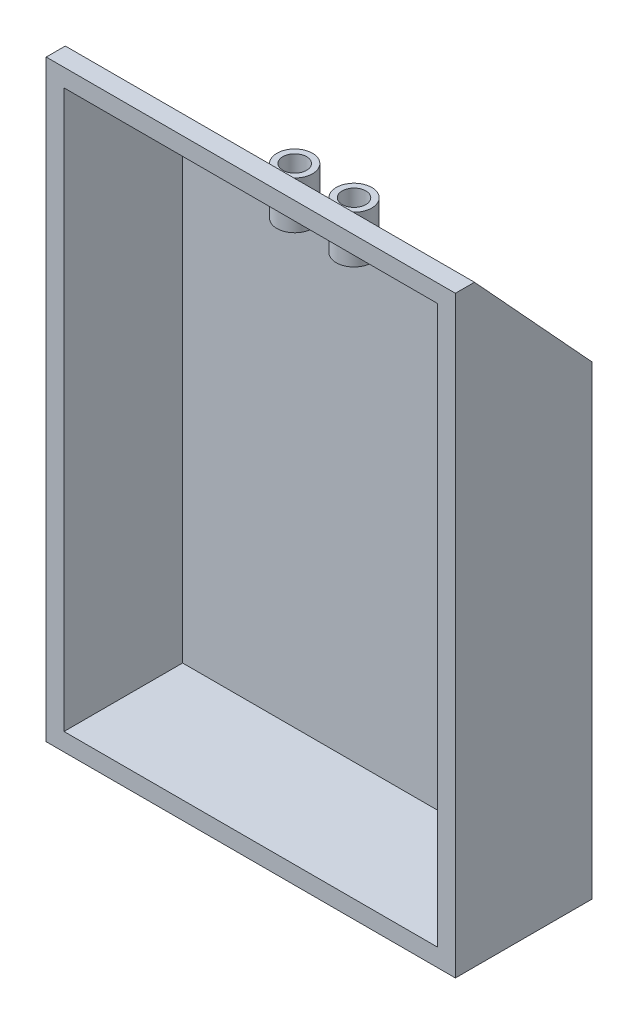
ISO-10303-21;
HEADER;
FILE_DESCRIPTION(('STEP AP214'),'2;1');
FILE_NAME('part.step','',(''),(''),'','','');
FILE_SCHEMA(('AUTOMOTIVE_DESIGN { 1 0 10303 214 1 1 1 1 }'));
ENDSEC;
DATA;
#1=APPLICATION_CONTEXT('core data for automotive mechanical design processes');
#2=APPLICATION_PROTOCOL_DEFINITION('international standard','automotive_design',2000,#1);
#3=PRODUCT_CONTEXT('',#1,'mechanical');
#4=PRODUCT('Part','Part','',(#3));
#5=PRODUCT_RELATED_PRODUCT_CATEGORY('part','',(#4));
#6=PRODUCT_DEFINITION_FORMATION('','',#4);
#7=PRODUCT_DEFINITION_CONTEXT('part definition',#1,'design');
#8=PRODUCT_DEFINITION('design','',#6,#7);
#9=PRODUCT_DEFINITION_SHAPE('','',#8);
#10=(LENGTH_UNIT() NAMED_UNIT(*) SI_UNIT(.MILLI.,.METRE.));
#11=(NAMED_UNIT(*) PLANE_ANGLE_UNIT() SI_UNIT($,.RADIAN.));
#12=(NAMED_UNIT(*) SI_UNIT($,.STERADIAN.) SOLID_ANGLE_UNIT());
#13=UNCERTAINTY_MEASURE_WITH_UNIT(LENGTH_MEASURE(1.E-05),#10,'distance_accuracy_value','');
#14=(GEOMETRIC_REPRESENTATION_CONTEXT(3) GLOBAL_UNCERTAINTY_ASSIGNED_CONTEXT((#13)) GLOBAL_UNIT_ASSIGNED_CONTEXT((#10,
#11,#12)) REPRESENTATION_CONTEXT('',''));
#15=CARTESIAN_POINT('',(0.,0.,0.));
#16=DIRECTION('',(0.,0.,1.));
#17=DIRECTION('',(1.,0.,0.));
#18=AXIS2_PLACEMENT_3D('',#15,#16,#17);
#19=CARTESIAN_POINT('',(4.99999999999996,30.,10.5942261348185));
#20=DIRECTION('',(0.,1.,0.));
#21=DIRECTION('',(-1.,0.,0.));
#22=AXIS2_PLACEMENT_3D('',#19,#20,#21);
#23=CYLINDRICAL_SURFACE('',#22,3.);
#24=CARTESIAN_POINT('',(4.99999999999995,35.,10.5942261348185));
#25=DIRECTION('',(0.,1.,0.));
#26=DIRECTION('',(-1.,0.,0.));
#27=AXIS2_PLACEMENT_3D('',#24,#25,#26);
#28=CIRCLE('',#27,3.);
#29=CARTESIAN_POINT('',(7.65633836041043,35.,9.19999999999967));
#30=VERTEX_POINT('',#29);
#31=CARTESIAN_POINT('',(2.34366163958948,35.,9.19999999999967));
#32=VERTEX_POINT('',#31);
#33=EDGE_CURVE('E52',#30,#32,#28,.T.);
#34=ORIENTED_EDGE('',*,*,#33,.T.);
#35=CARTESIAN_POINT('',(4.99999999999996,36.5154631900204,10.5942261348185));
#36=DIRECTION('',(0.,-0.677056530820892,0.735931011761821));
#37=DIRECTION('',(0.,0.735931011761822,0.677056530820892));
#38=AXIS2_PLACEMENT_3D('',#35,#36,#37);
#39=ELLIPSE('',#38,4.43094463081639,3.);
#40=EDGE_CURVE('E40',#32,#30,#39,.T.);
#41=ORIENTED_EDGE('',*,*,#40,.T.);
#42=EDGE_LOOP('',(#34,#41));
#43=FACE_BOUND('',#42,.T.);
#44=ADVANCED_FACE('F36',(#43),#23,.F.);
#45=CARTESIAN_POINT('',(-5.00000000000004,30.,10.5942261348185));
#46=DIRECTION('',(0.,1.,0.));
#47=DIRECTION('',(-1.,0.,0.));
#48=AXIS2_PLACEMENT_3D('',#45,#46,#47);
#49=CYLINDRICAL_SURFACE('',#48,3.);
#50=CARTESIAN_POINT('',(-5.00000000000005,35.,10.5942261348185));
#51=DIRECTION('',(0.,1.,0.));
#52=DIRECTION('',(-1.,0.,0.));
#53=AXIS2_PLACEMENT_3D('',#50,#51,#52);
#54=CIRCLE('',#53,3.);
#55=CARTESIAN_POINT('',(-2.34366163958957,35.,9.19999999999967));
#56=VERTEX_POINT('',#55);
#57=CARTESIAN_POINT('',(-7.65633836041052,35.,9.19999999999967));
#58=VERTEX_POINT('',#57);
#59=EDGE_CURVE('E168',#56,#58,#54,.T.);
#60=ORIENTED_EDGE('',*,*,#59,.T.);
#61=CARTESIAN_POINT('',(-5.00000000000004,36.5154631900204,10.5942261348185));
#62=DIRECTION('',(0.,-0.677056530820892,0.735931011761821));
#63=DIRECTION('',(0.,0.735931011761822,0.677056530820892));
#64=AXIS2_PLACEMENT_3D('',#61,#62,#63);
#65=ELLIPSE('',#64,4.43094463081638,3.);
#66=EDGE_CURVE('E250',#58,#56,#65,.T.);
#67=ORIENTED_EDGE('',*,*,#66,.T.);
#68=EDGE_LOOP('',(#60,#67));
#69=FACE_BOUND('',#68,.T.);
#70=ADVANCED_FACE('F264',(#69),#49,.F.);
#71=CARTESIAN_POINT('',(-34.5,50.,3.));
#72=DIRECTION('',(1.,0.,0.));
#73=DIRECTION('',(0.,1.,0.));
#74=AXIS2_PLACEMENT_3D('',#71,#72,#73);
#75=PLANE('',#74);
#76=DIRECTION('',(0.,-1.,0.));
#77=VECTOR('',#76,1.);
#78=CARTESIAN_POINT('',(-34.5,50.,23.));
#79=LINE('',#78,#77);
#80=CARTESIAN_POINT('',(-34.5,50.,23.));
#81=VERTEX_POINT('',#80);
#82=CARTESIAN_POINT('',(-34.5,-50.,23.));
#83=VERTEX_POINT('',#82);
#84=EDGE_CURVE('E230',#81,#83,#79,.T.);
#85=ORIENTED_EDGE('',*,*,#84,.F.);
#86=DIRECTION('',(0.,0.,1.));
#87=VECTOR('',#86,1.);
#88=CARTESIAN_POINT('',(-34.5,50.,23.));
#89=LINE('',#88,#87);
#90=CARTESIAN_POINT('',(-34.5,50.,19.7799999999999));
#91=VERTEX_POINT('',#90);
#92=EDGE_CURVE('E181',#91,#81,#89,.T.);
#93=ORIENTED_EDGE('',*,*,#92,.F.);
#94=DIRECTION('',(0.,0.735931011761822,0.677056530820892));
#95=VECTOR('',#94,1.);
#96=CARTESIAN_POINT('',(-34.5,50.,19.7799999999999));
#97=LINE('',#96,#95);
#98=CARTESIAN_POINT('',(-34.5,28.5000000000006,0.));
#99=VERTEX_POINT('',#98);
#100=EDGE_CURVE('E178',#99,#91,#97,.T.);
#101=ORIENTED_EDGE('',*,*,#100,.F.);
#102=DIRECTION('',(0.,-1.,0.));
#103=VECTOR('',#102,1.);
#104=CARTESIAN_POINT('',(-34.5,50.,0.));
#105=LINE('',#104,#103);
#106=CARTESIAN_POINT('',(-34.5,-50.,0.));
#107=VERTEX_POINT('',#106);
#108=EDGE_CURVE('E240',#99,#107,#105,.T.);
#109=ORIENTED_EDGE('',*,*,#108,.T.);
#110=DIRECTION('',(0.,0.,-1.));
#111=VECTOR('',#110,1.);
#112=CARTESIAN_POINT('',(-34.5,-50.,3.));
#113=LINE('',#112,#111);
#114=EDGE_CURVE('E45',#83,#107,#113,.T.);
#115=ORIENTED_EDGE('',*,*,#114,.F.);
#116=EDGE_LOOP('',(#85,#93,#101,#109,#115));
#117=FACE_BOUND('',#116,.T.);
#118=ADVANCED_FACE('F38',(#117),#75,.F.);
#119=CARTESIAN_POINT('',(-34.5,-50.,3.));
#120=DIRECTION('',(0.,1.,0.));
#121=DIRECTION('',(0.,0.,1.));
#122=AXIS2_PLACEMENT_3D('',#119,#120,#121);
#123=PLANE('',#122);
#124=DIRECTION('',(1.,0.,0.));
#125=VECTOR('',#124,1.);
#126=CARTESIAN_POINT('',(-34.5,-50.,0.));
#127=LINE('',#126,#125);
#128=CARTESIAN_POINT('',(34.5,-50.,0.));
#129=VERTEX_POINT('',#128);
#130=EDGE_CURVE('E242',#107,#129,#127,.T.);
#131=ORIENTED_EDGE('',*,*,#130,.T.);
#132=DIRECTION('',(0.,0.,-1.));
#133=VECTOR('',#132,1.);
#134=CARTESIAN_POINT('',(34.5,-50.,3.));
#135=LINE('',#134,#133);
#136=CARTESIAN_POINT('',(34.5,-50.,23.));
#137=VERTEX_POINT('',#136);
#138=EDGE_CURVE('E246',#137,#129,#135,.T.);
#139=ORIENTED_EDGE('',*,*,#138,.F.);
#140=DIRECTION('',(1.,0.,0.));
#141=VECTOR('',#140,1.);
#142=CARTESIAN_POINT('',(-34.5,-50.,23.));
#143=LINE('',#142,#141);
#144=EDGE_CURVE('E233',#83,#137,#143,.T.);
#145=ORIENTED_EDGE('',*,*,#144,.F.);
#146=ORIENTED_EDGE('',*,*,#114,.T.);
#147=EDGE_LOOP('',(#131,#139,#145,#146));
#148=FACE_BOUND('',#147,.T.);
#149=ADVANCED_FACE('F481',(#148),#123,.F.);
#150=CARTESIAN_POINT('',(34.5,50.,3.));
#151=DIRECTION('',(-1.,0.,0.));
#152=DIRECTION('',(0.,-1.,0.));
#153=AXIS2_PLACEMENT_3D('',#150,#151,#152);
#154=PLANE('',#153);
#155=DIRECTION('',(0.,1.,0.));
#156=VECTOR('',#155,1.);
#157=CARTESIAN_POINT('',(34.5,50.,0.));
#158=LINE('',#157,#156);
#159=CARTESIAN_POINT('',(34.5,28.5000000000006,0.));
#160=VERTEX_POINT('',#159);
#161=EDGE_CURVE('E244',#129,#160,#158,.T.);
#162=ORIENTED_EDGE('',*,*,#161,.T.);
#163=DIRECTION('',(0.,0.735931011761822,0.677056530820892));
#164=VECTOR('',#163,1.);
#165=CARTESIAN_POINT('',(34.5,50.,19.7799999999999));
#166=LINE('',#165,#164);
#167=CARTESIAN_POINT('',(34.5,50.,19.7799999999999));
#168=VERTEX_POINT('',#167);
#169=EDGE_CURVE('E176',#160,#168,#166,.T.);
#170=ORIENTED_EDGE('',*,*,#169,.T.);
#171=DIRECTION('',(0.,0.,1.));
#172=VECTOR('',#171,1.);
#173=CARTESIAN_POINT('',(34.5,50.,23.));
#174=LINE('',#173,#172);
#175=CARTESIAN_POINT('',(34.5,50.,23.));
#176=VERTEX_POINT('',#175);
#177=EDGE_CURVE('E182',#168,#176,#174,.T.);
#178=ORIENTED_EDGE('',*,*,#177,.T.);
#179=DIRECTION('',(0.,1.,0.));
#180=VECTOR('',#179,1.);
#181=CARTESIAN_POINT('',(34.5,50.,23.));
#182=LINE('',#181,#180);
#183=EDGE_CURVE('E236',#137,#176,#182,.T.);
#184=ORIENTED_EDGE('',*,*,#183,.F.);
#185=ORIENTED_EDGE('',*,*,#138,.T.);
#186=EDGE_LOOP('',(#162,#170,#178,#184,#185));
#187=FACE_BOUND('',#186,.T.);
#188=ADVANCED_FACE('F467',(#187),#154,.F.);
#189=CARTESIAN_POINT('',(0.,0.,0.));
#190=DIRECTION('',(0.,0.,1.));
#191=DIRECTION('',(1.,0.,0.));
#192=AXIS2_PLACEMENT_3D('',#189,#190,#191);
#193=PLANE('',#192);
#194=ORIENTED_EDGE('',*,*,#108,.F.);
#195=DIRECTION('',(1.,0.,0.));
#196=VECTOR('',#195,1.);
#197=CARTESIAN_POINT('',(-34.5,28.5000000000006,0.));
#198=LINE('',#197,#196);
#199=EDGE_CURVE('E185',#99,#160,#198,.T.);
#200=ORIENTED_EDGE('',*,*,#199,.T.);
#201=ORIENTED_EDGE('',*,*,#161,.F.);
#202=ORIENTED_EDGE('',*,*,#130,.F.);
#203=EDGE_LOOP('',(#194,#200,#201,#202));
#204=FACE_BOUND('',#203,.T.);
#205=ADVANCED_FACE('F460',(#204),#193,.F.);
#206=CARTESIAN_POINT('',(0.,0.,23.));
#207=DIRECTION('',(0.,0.,1.));
#208=DIRECTION('',(1.,0.,0.));
#209=AXIS2_PLACEMENT_3D('',#206,#207,#208);
#210=PLANE('',#209);
#211=ORIENTED_EDGE('',*,*,#84,.T.);
#212=ORIENTED_EDGE('',*,*,#144,.T.);
#213=ORIENTED_EDGE('',*,*,#183,.T.);
#214=DIRECTION('',(-1.,0.,0.));
#215=VECTOR('',#214,1.);
#216=CARTESIAN_POINT('',(-34.5,50.,23.));
#217=LINE('',#216,#215);
#218=EDGE_CURVE('E238',#176,#81,#217,.T.);
#219=ORIENTED_EDGE('',*,*,#218,.T.);
#220=EDGE_LOOP('',(#211,#212,#213,#219));
#221=FACE_BOUND('',#220,.T.);
#222=DIRECTION('',(0.,-1.,0.));
#223=VECTOR('',#222,1.);
#224=CARTESIAN_POINT('',(-31.5,47.,23.));
#225=LINE('',#224,#223);
#226=CARTESIAN_POINT('',(-31.5,47.,23.));
#227=VERTEX_POINT('',#226);
#228=CARTESIAN_POINT('',(-31.5,-47.,23.));
#229=VERTEX_POINT('',#228);
#230=EDGE_CURVE('E206',#227,#229,#225,.T.);
#231=ORIENTED_EDGE('',*,*,#230,.F.);
#232=DIRECTION('',(-1.,0.,0.));
#233=VECTOR('',#232,1.);
#234=CARTESIAN_POINT('',(-31.5,47.,23.));
#235=LINE('',#234,#233);
#236=CARTESIAN_POINT('',(31.5,47.,23.));
#237=VERTEX_POINT('',#236);
#238=EDGE_CURVE('E204',#237,#227,#235,.T.);
#239=ORIENTED_EDGE('',*,*,#238,.F.);
#240=DIRECTION('',(0.,1.,0.));
#241=VECTOR('',#240,1.);
#242=CARTESIAN_POINT('',(31.5,47.,23.));
#243=LINE('',#242,#241);
#244=CARTESIAN_POINT('',(31.5,-47.,23.));
#245=VERTEX_POINT('',#244);
#246=EDGE_CURVE('E212',#245,#237,#243,.T.);
#247=ORIENTED_EDGE('',*,*,#246,.F.);
#248=DIRECTION('',(1.,0.,0.));
#249=VECTOR('',#248,1.);
#250=CARTESIAN_POINT('',(-31.5,-47.,23.));
#251=LINE('',#250,#249);
#252=EDGE_CURVE('E209',#229,#245,#251,.T.);
#253=ORIENTED_EDGE('',*,*,#252,.F.);
#254=EDGE_LOOP('',(#231,#239,#247,#253));
#255=FACE_BOUND('',#254,.T.);
#256=ADVANCED_FACE('F282',(#221,#255),#210,.T.);
#257=CARTESIAN_POINT('',(-31.5,47.,23.));
#258=DIRECTION('',(0.,-1.,0.));
#259=DIRECTION('',(0.,0.,-1.));
#260=AXIS2_PLACEMENT_3D('',#257,#258,#259);
#261=PLANE('',#260);
#262=DIRECTION('',(-1.,0.,0.));
#263=VECTOR('',#262,1.);
#264=CARTESIAN_POINT('',(-31.5,47.,20.2399999999999));
#265=LINE('',#264,#263);
#266=CARTESIAN_POINT('',(31.5,47.,20.2399999999999));
#267=VERTEX_POINT('',#266);
#268=CARTESIAN_POINT('',(-31.5,47.,20.2399999999999));
#269=VERTEX_POINT('',#268);
#270=EDGE_CURVE('E200',#267,#269,#265,.T.);
#271=ORIENTED_EDGE('',*,*,#270,.F.);
#272=DIRECTION('',(0.,0.,-1.));
#273=VECTOR('',#272,1.);
#274=CARTESIAN_POINT('',(31.5,47.,23.));
#275=LINE('',#274,#273);
#276=EDGE_CURVE('E214',#237,#267,#275,.T.);
#277=ORIENTED_EDGE('',*,*,#276,.F.);
#278=ORIENTED_EDGE('',*,*,#238,.T.);
#279=DIRECTION('',(0.,0.,-1.));
#280=VECTOR('',#279,1.);
#281=CARTESIAN_POINT('',(-31.5,47.,23.));
#282=LINE('',#281,#280);
#283=EDGE_CURVE('E227',#227,#269,#282,.T.);
#284=ORIENTED_EDGE('',*,*,#283,.T.);
#285=EDGE_LOOP('',(#271,#277,#278,#284));
#286=FACE_BOUND('',#285,.T.);
#287=ADVANCED_FACE('F278',(#286),#261,.T.);
#288=CARTESIAN_POINT('',(-31.5,47.,23.));
#289=DIRECTION('',(1.,0.,0.));
#290=DIRECTION('',(0.,1.,0.));
#291=AXIS2_PLACEMENT_3D('',#288,#289,#290);
#292=PLANE('',#291);
#293=DIRECTION('',(0.,-0.735931011761822,-0.677056530820892));
#294=VECTOR('',#293,1.);
#295=CARTESIAN_POINT('',(-31.5,48.3752166377817,21.5051993067591));
#296=LINE('',#295,#294);
#297=CARTESIAN_POINT('',(-31.5,28.2608695652179,3.));
#298=VERTEX_POINT('',#297);
#299=EDGE_CURVE('E197',#269,#298,#296,.T.);
#300=ORIENTED_EDGE('',*,*,#299,.F.);
#301=ORIENTED_EDGE('',*,*,#283,.F.);
#302=ORIENTED_EDGE('',*,*,#230,.T.);
#303=DIRECTION('',(0.,0.,-1.));
#304=VECTOR('',#303,1.);
#305=CARTESIAN_POINT('',(-31.5,-47.,23.));
#306=LINE('',#305,#304);
#307=CARTESIAN_POINT('',(-31.5,-47.,3.));
#308=VERTEX_POINT('',#307);
#309=EDGE_CURVE('E224',#229,#308,#306,.T.);
#310=ORIENTED_EDGE('',*,*,#309,.T.);
#311=DIRECTION('',(0.,-1.,0.));
#312=VECTOR('',#311,1.);
#313=CARTESIAN_POINT('',(-31.5,47.,3.));
#314=LINE('',#313,#312);
#315=EDGE_CURVE('E203',#298,#308,#314,.T.);
#316=ORIENTED_EDGE('',*,*,#315,.F.);
#317=EDGE_LOOP('',(#300,#301,#302,#310,#316));
#318=FACE_BOUND('',#317,.T.);
#319=ADVANCED_FACE('F286',(#318),#292,.T.);
#320=CARTESIAN_POINT('',(-31.5,-47.,23.));
#321=DIRECTION('',(0.,1.,0.));
#322=DIRECTION('',(0.,0.,1.));
#323=AXIS2_PLACEMENT_3D('',#320,#321,#322);
#324=PLANE('',#323);
#325=DIRECTION('',(1.,0.,0.));
#326=VECTOR('',#325,1.);
#327=CARTESIAN_POINT('',(-31.5,-47.,3.));
#328=LINE('',#327,#326);
#329=CARTESIAN_POINT('',(31.5,-47.,3.));
#330=VERTEX_POINT('',#329);
#331=EDGE_CURVE('E216',#308,#330,#328,.T.);
#332=ORIENTED_EDGE('',*,*,#331,.F.);
#333=ORIENTED_EDGE('',*,*,#309,.F.);
#334=ORIENTED_EDGE('',*,*,#252,.T.);
#335=DIRECTION('',(0.,0.,-1.));
#336=VECTOR('',#335,1.);
#337=CARTESIAN_POINT('',(31.5,-47.,23.));
#338=LINE('',#337,#336);
#339=EDGE_CURVE('E221',#245,#330,#338,.T.);
#340=ORIENTED_EDGE('',*,*,#339,.T.);
#341=EDGE_LOOP('',(#332,#333,#334,#340));
#342=FACE_BOUND('',#341,.T.);
#343=ADVANCED_FACE('F290',(#342),#324,.T.);
#344=CARTESIAN_POINT('',(31.5,47.,23.));
#345=DIRECTION('',(-1.,0.,0.));
#346=DIRECTION('',(0.,-1.,0.));
#347=AXIS2_PLACEMENT_3D('',#344,#345,#346);
#348=PLANE('',#347);
#349=DIRECTION('',(0.,0.735931011761822,0.677056530820892));
#350=VECTOR('',#349,1.);
#351=CARTESIAN_POINT('',(31.5,48.3752166377817,21.5051993067591));
#352=LINE('',#351,#350);
#353=CARTESIAN_POINT('',(31.5,28.2608695652179,3.));
#354=VERTEX_POINT('',#353);
#355=EDGE_CURVE('E192',#354,#267,#352,.T.);
#356=ORIENTED_EDGE('',*,*,#355,.F.);
#357=DIRECTION('',(0.,1.,0.));
#358=VECTOR('',#357,1.);
#359=CARTESIAN_POINT('',(31.5,47.,3.));
#360=LINE('',#359,#358);
#361=EDGE_CURVE('E207',#330,#354,#360,.T.);
#362=ORIENTED_EDGE('',*,*,#361,.F.);
#363=ORIENTED_EDGE('',*,*,#339,.F.);
#364=ORIENTED_EDGE('',*,*,#246,.T.);
#365=ORIENTED_EDGE('',*,*,#276,.T.);
#366=EDGE_LOOP('',(#356,#362,#363,#364,#365));
#367=FACE_BOUND('',#366,.T.);
#368=ADVANCED_FACE('F273',(#367),#348,.T.);
#369=CARTESIAN_POINT('',(0.,0.,3.));
#370=DIRECTION('',(0.,0.,1.));
#371=DIRECTION('',(1.,0.,0.));
#372=AXIS2_PLACEMENT_3D('',#369,#370,#371);
#373=PLANE('',#372);
#374=DIRECTION('',(1.,0.,0.));
#375=VECTOR('',#374,1.);
#376=CARTESIAN_POINT('',(0.,28.2608695652179,3.));
#377=LINE('',#376,#375);
#378=EDGE_CURVE('E11',#298,#354,#377,.T.);
#379=ORIENTED_EDGE('',*,*,#378,.F.);
#380=ORIENTED_EDGE('',*,*,#315,.T.);
#381=ORIENTED_EDGE('',*,*,#331,.T.);
#382=ORIENTED_EDGE('',*,*,#361,.T.);
#383=EDGE_LOOP('',(#379,#380,#381,#382));
#384=FACE_BOUND('',#383,.T.);
#385=ADVANCED_FACE('F292',(#384),#373,.T.);
#386=CARTESIAN_POINT('',(-34.5,50.,19.7799999999999));
#387=DIRECTION('',(0.,0.677056530820892,-0.735931011761822));
#388=DIRECTION('',(0.,0.735931011761822,0.677056530820892));
#389=AXIS2_PLACEMENT_3D('',#386,#387,#388);
#390=PLANE('',#389);
#391=CARTESIAN_POINT('',(4.99999999999995,40.0154631900204,10.5942261348185));
#392=DIRECTION('',(0.,0.677056530820892,-0.735931011761822));
#393=DIRECTION('',(0.,0.735931011761822,0.677056530820892));
#394=AXIS2_PLACEMENT_3D('',#391,#392,#393);
#395=ELLIPSE('',#394,4.43094463081639,3.);
#396=CARTESIAN_POINT('',(6.20860493184799,43.,13.3399999999998));
#397=VERTEX_POINT('',#396);
#398=CARTESIAN_POINT('',(3.79139506815192,43.,13.3399999999998));
#399=VERTEX_POINT('',#398);
#400=EDGE_CURVE('E170',#397,#399,#395,.T.);
#401=ORIENTED_EDGE('',*,*,#400,.F.);
#402=EDGE_CURVE('E139',#399,#397,#395,.T.);
#403=ORIENTED_EDGE('',*,*,#402,.F.);
#404=EDGE_LOOP('',(#401,#403));
#405=FACE_BOUND('',#404,.T.);
#406=CARTESIAN_POINT('',(-5.00000000000005,40.0154631900204,10.5942261348185));
#407=DIRECTION('',(0.,0.677056530820892,-0.735931011761822));
#408=DIRECTION('',(0.,0.735931011761822,0.677056530820892));
#409=AXIS2_PLACEMENT_3D('',#406,#407,#408);
#410=ELLIPSE('',#409,4.43094463081638,3.);
#411=CARTESIAN_POINT('',(-3.79139506815202,43.,13.3399999999998));
#412=VERTEX_POINT('',#411);
#413=CARTESIAN_POINT('',(-6.20860493184808,43.,13.3399999999998));
#414=VERTEX_POINT('',#413);
#415=EDGE_CURVE('E173',#412,#414,#410,.T.);
#416=ORIENTED_EDGE('',*,*,#415,.F.);
#417=EDGE_CURVE('E177',#414,#412,#410,.T.);
#418=ORIENTED_EDGE('',*,*,#417,.F.);
#419=EDGE_LOOP('',(#416,#418));
#420=FACE_BOUND('',#419,.T.);
#421=ORIENTED_EDGE('',*,*,#169,.F.);
#422=ORIENTED_EDGE('',*,*,#199,.F.);
#423=ORIENTED_EDGE('',*,*,#100,.T.);
#424=DIRECTION('',(1.,0.,0.));
#425=VECTOR('',#424,1.);
#426=CARTESIAN_POINT('',(-34.5,50.,19.7799999999999));
#427=LINE('',#426,#425);
#428=EDGE_CURVE('E190',#91,#168,#427,.T.);
#429=ORIENTED_EDGE('',*,*,#428,.T.);
#430=EDGE_LOOP('',(#421,#422,#423,#429));
#431=FACE_BOUND('',#430,.T.);
#432=ADVANCED_FACE('F294',(#405,#420,#431),#390,.T.);
#433=CARTESIAN_POINT('',(-34.5,50.,23.));
#434=DIRECTION('',(0.,1.,0.));
#435=DIRECTION('',(-1.,0.,0.));
#436=AXIS2_PLACEMENT_3D('',#433,#434,#435);
#437=PLANE('',#436);
#438=ORIENTED_EDGE('',*,*,#177,.F.);
#439=ORIENTED_EDGE('',*,*,#428,.F.);
#440=ORIENTED_EDGE('',*,*,#92,.T.);
#441=ORIENTED_EDGE('',*,*,#218,.F.);
#442=EDGE_LOOP('',(#438,#439,#440,#441));
#443=FACE_BOUND('',#442,.T.);
#444=ADVANCED_FACE('F268',(#443),#437,.T.);
#445=CARTESIAN_POINT('',(-34.5,25.0000000000006,0.));
#446=DIRECTION('',(0.,-0.677056530820892,0.735931011761821));
#447=DIRECTION('',(0.,-0.735931011761822,-0.677056530820892));
#448=AXIS2_PLACEMENT_3D('',#445,#446,#447);
#449=PLANE('',#448);
#450=ORIENTED_EDGE('',*,*,#40,.F.);
#451=EDGE_CURVE('E140',#30,#32,#39,.T.);
#452=ORIENTED_EDGE('',*,*,#451,.F.);
#453=EDGE_LOOP('',(#450,#452));
#454=FACE_BOUND('',#453,.T.);
#455=ORIENTED_EDGE('',*,*,#66,.F.);
#456=EDGE_CURVE('E172',#56,#58,#65,.T.);
#457=ORIENTED_EDGE('',*,*,#456,.F.);
#458=EDGE_LOOP('',(#455,#457));
#459=FACE_BOUND('',#458,.T.);
#460=ORIENTED_EDGE('',*,*,#355,.T.);
#461=ORIENTED_EDGE('',*,*,#270,.T.);
#462=ORIENTED_EDGE('',*,*,#299,.T.);
#463=ORIENTED_EDGE('',*,*,#378,.T.);
#464=EDGE_LOOP('',(#460,#461,#462,#463));
#465=FACE_BOUND('',#464,.T.);
#466=ADVANCED_FACE('F142',(#454,#459,#465),#449,.T.);
#467=ORIENTED_EDGE('',*,*,#417,.T.);
#468=CARTESIAN_POINT('',(-5.00000000000005,43.,10.5942261348185));
#469=DIRECTION('',(0.,1.,0.));
#470=DIRECTION('',(-1.,0.,0.));
#471=AXIS2_PLACEMENT_3D('',#468,#469,#470);
#472=CIRCLE('',#471,3.);
#473=EDGE_CURVE('E146',#414,#412,#472,.T.);
#474=ORIENTED_EDGE('',*,*,#473,.F.);
#475=EDGE_LOOP('',(#467,#474));
#476=FACE_BOUND('',#475,.T.);
#477=ADVANCED_FACE('F267',(#476),#49,.F.);
#478=ORIENTED_EDGE('',*,*,#402,.T.);
#479=CARTESIAN_POINT('',(4.99999999999995,43.,10.5942261348185));
#480=DIRECTION('',(0.,1.,0.));
#481=DIRECTION('',(-1.,0.,0.));
#482=AXIS2_PLACEMENT_3D('',#479,#480,#481);
#483=CIRCLE('',#482,3.);
#484=EDGE_CURVE('E154',#399,#397,#483,.T.);
#485=ORIENTED_EDGE('',*,*,#484,.F.);
#486=EDGE_LOOP('',(#478,#485));
#487=FACE_BOUND('',#486,.T.);
#488=ADVANCED_FACE('F307',(#487),#23,.F.);
#489=CARTESIAN_POINT('',(-5.00000000000005,43.,10.5942261348185));
#490=DIRECTION('',(0.,-1.,0.));
#491=DIRECTION('',(1.,0.,0.));
#492=AXIS2_PLACEMENT_3D('',#489,#490,#491);
#493=CYLINDRICAL_SURFACE('',#492,3.);
#494=ORIENTED_EDGE('',*,*,#415,.T.);
#495=EDGE_CURVE('E167',#412,#414,#472,.T.);
#496=ORIENTED_EDGE('',*,*,#495,.F.);
#497=EDGE_LOOP('',(#494,#496));
#498=FACE_BOUND('',#497,.T.);
#499=ADVANCED_FACE('F314',(#498),#493,.T.);
#500=CARTESIAN_POINT('',(-5.00000000000005,43.,10.5942261348185));
#501=DIRECTION('',(0.,1.,0.));
#502=DIRECTION('',(-1.,0.,0.));
#503=AXIS2_PLACEMENT_3D('',#500,#501,#502);
#504=PLANE('',#503);
#505=ORIENTED_EDGE('',*,*,#473,.T.);
#506=ORIENTED_EDGE('',*,*,#495,.T.);
#507=EDGE_LOOP('',(#505,#506));
#508=FACE_BOUND('',#507,.T.);
#509=CARTESIAN_POINT('',(-5.00000000000005,43.,10.5942261348185));
#510=DIRECTION('',(0.,1.,0.));
#511=DIRECTION('',(-1.,0.,0.));
#512=AXIS2_PLACEMENT_3D('',#509,#510,#511);
#513=CIRCLE('',#512,2.);
#514=CARTESIAN_POINT('',(-7.00000000000005,43.,10.5942261348185));
#515=VERTEX_POINT('',#514);
#516=EDGE_CURVE('E158',#515,#515,#513,.T.);
#517=ORIENTED_EDGE('',*,*,#516,.F.);
#518=EDGE_LOOP('',(#517));
#519=FACE_BOUND('',#518,.T.);
#520=ADVANCED_FACE('F320',(#508,#519),#504,.T.);
#521=CARTESIAN_POINT('',(-5.00000000000005,35.,10.5942261348185));
#522=DIRECTION('',(0.,1.,0.));
#523=DIRECTION('',(-1.,0.,0.));
#524=AXIS2_PLACEMENT_3D('',#521,#522,#523);
#525=PLANE('',#524);
#526=ORIENTED_EDGE('',*,*,#59,.F.);
#527=EDGE_CURVE('E161',#58,#56,#54,.T.);
#528=ORIENTED_EDGE('',*,*,#527,.F.);
#529=EDGE_LOOP('',(#526,#528));
#530=FACE_BOUND('',#529,.T.);
#531=CARTESIAN_POINT('',(-5.00000000000005,35.,10.5942261348185));
#532=DIRECTION('',(0.,1.,0.));
#533=DIRECTION('',(-1.,0.,0.));
#534=AXIS2_PLACEMENT_3D('',#531,#532,#533);
#535=CIRCLE('',#534,2.);
#536=CARTESIAN_POINT('',(-7.00000000000005,35.,10.5942261348185));
#537=VERTEX_POINT('',#536);
#538=EDGE_CURVE('E162',#537,#537,#535,.T.);
#539=ORIENTED_EDGE('',*,*,#538,.T.);
#540=EDGE_LOOP('',(#539));
#541=FACE_BOUND('',#540,.T.);
#542=ADVANCED_FACE('F262',(#530,#541),#525,.F.);
#543=ORIENTED_EDGE('',*,*,#456,.T.);
#544=ORIENTED_EDGE('',*,*,#527,.T.);
#545=EDGE_LOOP('',(#543,#544));
#546=FACE_BOUND('',#545,.T.);
#547=ADVANCED_FACE('F259',(#546),#493,.T.);
#548=CARTESIAN_POINT('',(-5.00000000000005,43.,10.5942261348185));
#549=DIRECTION('',(0.,-1.,0.));
#550=DIRECTION('',(1.,0.,0.));
#551=AXIS2_PLACEMENT_3D('',#548,#549,#550);
#552=CYLINDRICAL_SURFACE('',#551,2.);
#553=ORIENTED_EDGE('',*,*,#516,.T.);
#554=EDGE_LOOP('',(#553));
#555=FACE_BOUND('',#554,.T.);
#556=ORIENTED_EDGE('',*,*,#538,.F.);
#557=EDGE_LOOP('',(#556));
#558=FACE_BOUND('',#557,.T.);
#559=ADVANCED_FACE('F352',(#555,#558),#552,.F.);
#560=CARTESIAN_POINT('',(4.99999999999995,43.,10.5942261348185));
#561=DIRECTION('',(0.,-1.,0.));
#562=DIRECTION('',(1.,0.,0.));
#563=AXIS2_PLACEMENT_3D('',#560,#561,#562);
#564=CYLINDRICAL_SURFACE('',#563,3.);
#565=ORIENTED_EDGE('',*,*,#400,.T.);
#566=EDGE_CURVE('E59',#397,#399,#483,.T.);
#567=ORIENTED_EDGE('',*,*,#566,.F.);
#568=EDGE_LOOP('',(#565,#567));
#569=FACE_BOUND('',#568,.T.);
#570=ADVANCED_FACE('F329',(#569),#564,.T.);
#571=CARTESIAN_POINT('',(4.99999999999995,43.,10.5942261348185));
#572=DIRECTION('',(0.,1.,0.));
#573=DIRECTION('',(-1.,0.,0.));
#574=AXIS2_PLACEMENT_3D('',#571,#572,#573);
#575=PLANE('',#574);
#576=ORIENTED_EDGE('',*,*,#484,.T.);
#577=ORIENTED_EDGE('',*,*,#566,.T.);
#578=EDGE_LOOP('',(#576,#577));
#579=FACE_BOUND('',#578,.T.);
#580=CARTESIAN_POINT('',(4.99999999999995,43.,10.5942261348185));
#581=DIRECTION('',(0.,1.,0.));
#582=DIRECTION('',(-1.,0.,0.));
#583=AXIS2_PLACEMENT_3D('',#580,#581,#582);
#584=CIRCLE('',#583,2.);
#585=CARTESIAN_POINT('',(2.99999999999995,43.,10.5942261348185));
#586=VERTEX_POINT('',#585);
#587=EDGE_CURVE('E150',#586,#586,#584,.T.);
#588=ORIENTED_EDGE('',*,*,#587,.F.);
#589=EDGE_LOOP('',(#588));
#590=FACE_BOUND('',#589,.T.);
#591=ADVANCED_FACE('F330',(#579,#590),#575,.T.);
#592=CARTESIAN_POINT('',(4.99999999999995,35.,10.5942261348185));
#593=DIRECTION('',(0.,1.,0.));
#594=DIRECTION('',(-1.,0.,0.));
#595=AXIS2_PLACEMENT_3D('',#592,#593,#594);
#596=PLANE('',#595);
#597=ORIENTED_EDGE('',*,*,#33,.F.);
#598=EDGE_CURVE('E147',#32,#30,#28,.T.);
#599=ORIENTED_EDGE('',*,*,#598,.F.);
#600=EDGE_LOOP('',(#597,#599));
#601=FACE_BOUND('',#600,.T.);
#602=CARTESIAN_POINT('',(4.99999999999995,35.,10.5942261348185));
#603=DIRECTION('',(0.,1.,0.));
#604=DIRECTION('',(-1.,0.,0.));
#605=AXIS2_PLACEMENT_3D('',#602,#603,#604);
#606=CIRCLE('',#605,2.);
#607=CARTESIAN_POINT('',(2.99999999999995,35.,10.5942261348185));
#608=VERTEX_POINT('',#607);
#609=EDGE_CURVE('E337',#608,#608,#606,.T.);
#610=ORIENTED_EDGE('',*,*,#609,.T.);
#611=EDGE_LOOP('',(#610));
#612=FACE_BOUND('',#611,.T.);
#613=ADVANCED_FACE('F152',(#601,#612),#596,.F.);
#614=ORIENTED_EDGE('',*,*,#451,.T.);
#615=ORIENTED_EDGE('',*,*,#598,.T.);
#616=EDGE_LOOP('',(#614,#615));
#617=FACE_BOUND('',#616,.T.);
#618=ADVANCED_FACE('F148',(#617),#564,.T.);
#619=CARTESIAN_POINT('',(4.99999999999995,43.,10.5942261348185));
#620=DIRECTION('',(0.,-1.,0.));
#621=DIRECTION('',(1.,0.,0.));
#622=AXIS2_PLACEMENT_3D('',#619,#620,#621);
#623=CYLINDRICAL_SURFACE('',#622,2.);
#624=ORIENTED_EDGE('',*,*,#587,.T.);
#625=EDGE_LOOP('',(#624));
#626=FACE_BOUND('',#625,.T.);
#627=ORIENTED_EDGE('',*,*,#609,.F.);
#628=EDGE_LOOP('',(#627));
#629=FACE_BOUND('',#628,.T.);
#630=ADVANCED_FACE('F342',(#626,#629),#623,.F.);
#631=CLOSED_SHELL('',(#44,#70,#118,#149,#188,#205,#256,#287,#319,#343,#368,#385,#432,#444,#466,
#477,#488,#499,#520,#542,#547,#559,#570,#591,#613,#618,#630));
#632=MANIFOLD_SOLID_BREP('B2',#631);
#633=ADVANCED_BREP_SHAPE_REPRESENTATION('',(#18,#632),#14);
#634=SHAPE_DEFINITION_REPRESENTATION(#9,#633);
ENDSEC;
END-ISO-10303-21;
